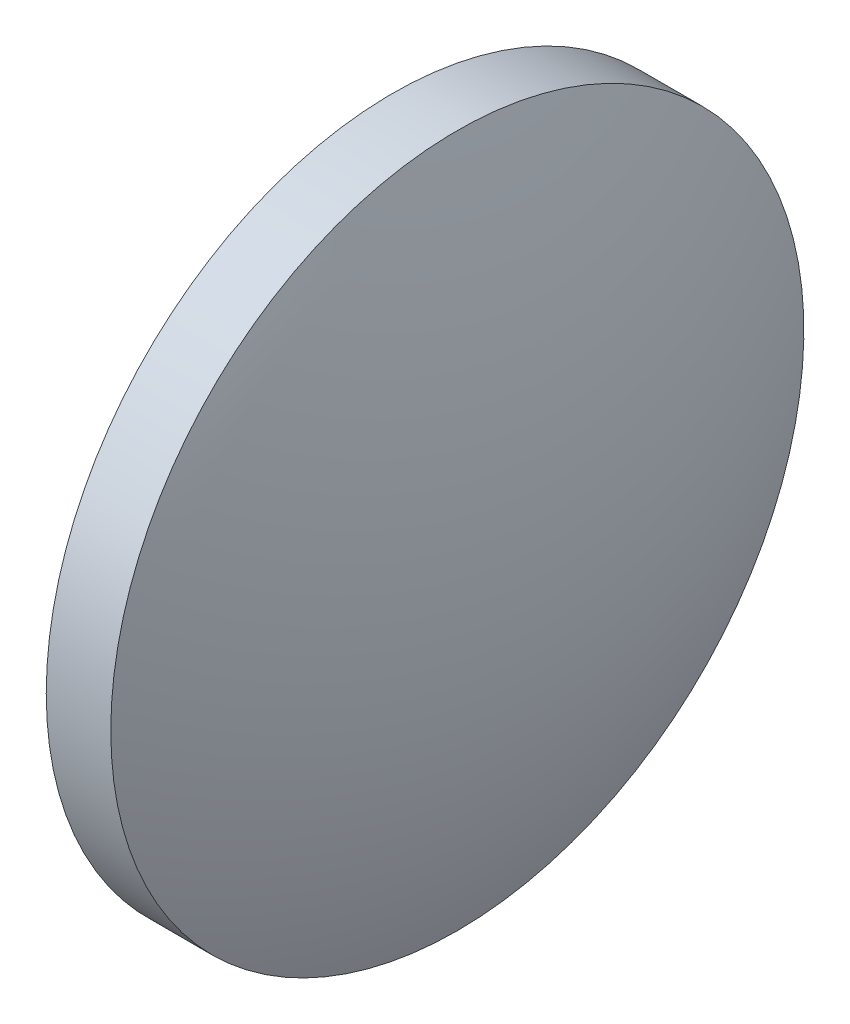
ISO-10303-21;
HEADER;
FILE_DESCRIPTION(('STEP AP214'),'2;1');
FILE_NAME('part.step','',(''),(''),'','','');
FILE_SCHEMA(('AUTOMOTIVE_DESIGN { 1 0 10303 214 1 1 1 1 }'));
ENDSEC;
DATA;
#1=APPLICATION_CONTEXT('core data for automotive mechanical design processes');
#2=APPLICATION_PROTOCOL_DEFINITION('international standard','automotive_design',2000,#1);
#3=PRODUCT_CONTEXT('',#1,'mechanical');
#4=PRODUCT('Part','Part','',(#3));
#5=PRODUCT_RELATED_PRODUCT_CATEGORY('part','',(#4));
#6=PRODUCT_DEFINITION_FORMATION('','',#4);
#7=PRODUCT_DEFINITION_CONTEXT('part definition',#1,'design');
#8=PRODUCT_DEFINITION('design','',#6,#7);
#9=PRODUCT_DEFINITION_SHAPE('','',#8);
#10=(LENGTH_UNIT() NAMED_UNIT(*) SI_UNIT(.MILLI.,.METRE.));
#11=(NAMED_UNIT(*) PLANE_ANGLE_UNIT() SI_UNIT($,.RADIAN.));
#12=(NAMED_UNIT(*) SI_UNIT($,.STERADIAN.) SOLID_ANGLE_UNIT());
#13=UNCERTAINTY_MEASURE_WITH_UNIT(LENGTH_MEASURE(1.E-05),#10,'distance_accuracy_value','');
#14=(GEOMETRIC_REPRESENTATION_CONTEXT(3) GLOBAL_UNCERTAINTY_ASSIGNED_CONTEXT((#13)) GLOBAL_UNIT_ASSIGNED_CONTEXT((#10,
#11,#12)) REPRESENTATION_CONTEXT('',''));
#15=CARTESIAN_POINT('',(0.,0.,0.));
#16=DIRECTION('',(0.,0.,1.));
#17=DIRECTION('',(1.,0.,0.));
#18=AXIS2_PLACEMENT_3D('',#15,#16,#17);
#19=CARTESIAN_POINT('',(519.066433238945,122.083366166087,0.));
#20=DIRECTION('',(-1.,0.,0.));
#21=DIRECTION('',(0.,-1.,0.));
#22=AXIS2_PLACEMENT_3D('',#19,#20,#21);
#23=SPHERICAL_SURFACE('',#22,20.6807763975154);
#24=CARTESIAN_POINT('',(538.137209636461,122.083366166087,0.));
#25=DIRECTION('',(-1.,0.,0.));
#26=DIRECTION('',(0.,0.,1.));
#27=AXIS2_PLACEMENT_3D('',#24,#25,#26);
#28=CIRCLE('',#27,7.99999999999999);
#29=CARTESIAN_POINT('',(538.137209636461,122.083366166087,7.99999999999999));
#30=VERTEX_POINT('',#29);
#31=EDGE_CURVE('E10',#30,#30,#28,.T.);
#32=ORIENTED_EDGE('',*,*,#31,.F.);
#33=EDGE_LOOP('',(#32));
#34=FACE_BOUND('',#33,.T.);
#35=ADVANCED_FACE('F35',(#34),#23,.T.);
#36=CARTESIAN_POINT('',(534.724392931615,122.083366166087,0.));
#37=DIRECTION('',(-1.,0.,0.));
#38=DIRECTION('',(0.,0.,1.));
#39=AXIS2_PLACEMENT_3D('',#36,#37,#38);
#40=CYLINDRICAL_SURFACE('',#39,7.99999999999999);
#41=CARTESIAN_POINT('',(536.647209636461,122.083366166087,0.));
#42=DIRECTION('',(-1.,0.,0.));
#43=DIRECTION('',(0.,0.,1.));
#44=AXIS2_PLACEMENT_3D('',#41,#42,#43);
#45=CIRCLE('',#44,7.99999999999999);
#46=CARTESIAN_POINT('',(536.647209636461,122.083366166087,7.99999999999999));
#47=VERTEX_POINT('',#46);
#48=EDGE_CURVE('E41',#47,#47,#45,.T.);
#49=ORIENTED_EDGE('',*,*,#48,.F.);
#50=EDGE_LOOP('',(#49));
#51=FACE_BOUND('',#50,.T.);
#52=ORIENTED_EDGE('',*,*,#31,.T.);
#53=EDGE_LOOP('',(#52));
#54=FACE_BOUND('',#53,.T.);
#55=ADVANCED_FACE('F49',(#51,#54),#40,.T.);
#56=CARTESIAN_POINT('',(536.647209636461,122.083366166087,0.));
#57=DIRECTION('',(1.,0.,0.));
#58=DIRECTION('',(0.,0.,-1.));
#59=AXIS2_PLACEMENT_3D('',#56,#57,#58);
#60=PLANE('',#59);
#61=ORIENTED_EDGE('',*,*,#48,.T.);
#62=EDGE_LOOP('',(#61));
#63=FACE_BOUND('',#62,.T.);
#64=ADVANCED_FACE('F47',(#63),#60,.F.);
#65=CLOSED_SHELL('',(#35,#55,#64));
#66=MANIFOLD_SOLID_BREP('B2',#65);
#67=ADVANCED_BREP_SHAPE_REPRESENTATION('',(#18,#66),#14);
#68=SHAPE_DEFINITION_REPRESENTATION(#9,#67);
ENDSEC;
END-ISO-10303-21;
